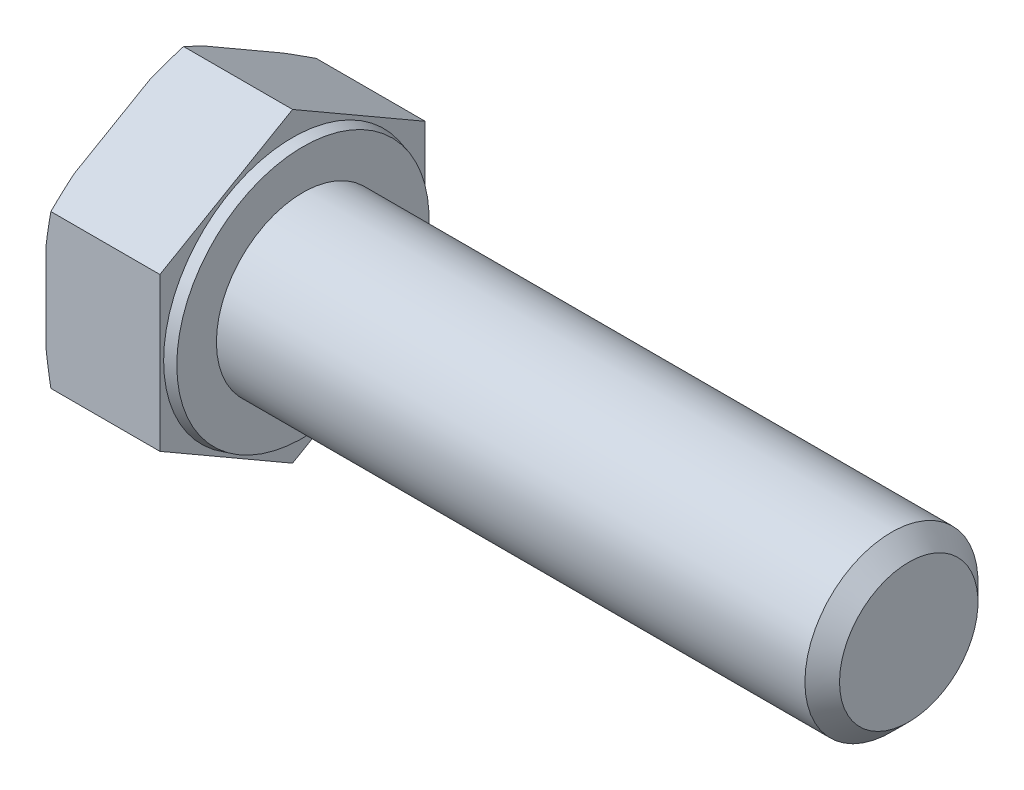
ISO-10303-21;
HEADER;
FILE_DESCRIPTION(('STEP AP214'),'2;1');
FILE_NAME('part.step','',(''),(''),'','','');
FILE_SCHEMA(('AUTOMOTIVE_DESIGN { 1 0 10303 214 1 1 1 1 }'));
ENDSEC;
DATA;
#1=APPLICATION_CONTEXT('core data for automotive mechanical design processes');
#2=APPLICATION_PROTOCOL_DEFINITION('international standard','automotive_design',2000,#1);
#3=PRODUCT_CONTEXT('',#1,'mechanical');
#4=PRODUCT('Part','Part','',(#3));
#5=PRODUCT_RELATED_PRODUCT_CATEGORY('part','',(#4));
#6=PRODUCT_DEFINITION_FORMATION('','',#4);
#7=PRODUCT_DEFINITION_CONTEXT('part definition',#1,'design');
#8=PRODUCT_DEFINITION('design','',#6,#7);
#9=PRODUCT_DEFINITION_SHAPE('','',#8);
#10=(LENGTH_UNIT() NAMED_UNIT(*) SI_UNIT(.MILLI.,.METRE.));
#11=(NAMED_UNIT(*) PLANE_ANGLE_UNIT() SI_UNIT($,.RADIAN.));
#12=(NAMED_UNIT(*) SI_UNIT($,.STERADIAN.) SOLID_ANGLE_UNIT());
#13=UNCERTAINTY_MEASURE_WITH_UNIT(LENGTH_MEASURE(1.E-05),#10,'distance_accuracy_value','');
#14=(GEOMETRIC_REPRESENTATION_CONTEXT(3) GLOBAL_UNCERTAINTY_ASSIGNED_CONTEXT((#13)) GLOBAL_UNIT_ASSIGNED_CONTEXT((#10,
#11,#12)) REPRESENTATION_CONTEXT('',''));
#15=CARTESIAN_POINT('',(0.,0.,0.));
#16=DIRECTION('',(0.,0.,1.));
#17=DIRECTION('',(1.,0.,0.));
#18=AXIS2_PLACEMENT_3D('',#15,#16,#17);
#19=CARTESIAN_POINT('',(35.6000000000001,-4.42500000000009,-7.66432482349223));
#20=DIRECTION('',(0.,-0.866025403784442,-0.499999999999995));
#21=DIRECTION('',(0.,0.499999999999995,-0.866025403784442));
#22=AXIS2_PLACEMENT_3D('',#19,#20,#21);
#23=PLANE('',#22);
#24=DIRECTION('',(-1.,0.,0.));
#25=VECTOR('',#24,1.);
#26=CARTESIAN_POINT('',(35.6000000000001,-8.85,0.));
#27=LINE('',#26,#25);
#28=CARTESIAN_POINT('',(0.,-8.85,0.));
#29=VERTEX_POINT('',#28);
#30=CARTESIAN_POINT('',(-6.29792306844368,-8.85,0.));
#31=VERTEX_POINT('',#30);
#32=EDGE_CURVE('E161',#29,#31,#27,.T.);
#33=ORIENTED_EDGE('',*,*,#32,.T.);
#34=CARTESIAN_POINT('',(-4.7699615006699,-11.9174022332107,5.3128965151713));
#35=CARTESIAN_POINT('',(-4.83614833570257,-11.8050473190038,5.11829209528478));
#36=CARTESIAN_POINT('',(-4.90167255003095,-11.6925948603644,4.92351872348535));
#37=CARTESIAN_POINT('',(-5.03118559698242,-11.4674663528304,4.53358471020429));
#38=CARTESIAN_POINT('',(-5.09517439305191,-11.3547902986816,4.33842405962226));
#39=CARTESIAN_POINT('',(-5.28456041407138,-11.0163157536771,3.75216895060564));
#40=CARTESIAN_POINT('',(-5.40733223857273,-10.7901468045143,3.3604328395613));
#41=CARTESIAN_POINT('',(-5.64480594732521,-10.3342684187143,2.57082831328319));
#42=CARTESIAN_POINT('',(-5.75941225873481,-10.1045464495324,2.17293819104533));
#43=CARTESIAN_POINT('',(-5.97591685440881,-9.6436033227612,1.37456127607789));
#44=CARTESIAN_POINT('',(-6.07781581130404,-9.41238224520544,0.974074621970502));
#45=CARTESIAN_POINT('',(-6.26134144326315,-8.95638364479248,0.184261877874948));
#46=CARTESIAN_POINT('',(-6.34355573274743,-8.73166601658844,-0.204960471530833));
#47=CARTESIAN_POINT('',(-6.48746045966098,-8.28055127837509,-0.986314118159495));
#48=CARTESIAN_POINT('',(-6.54915189984519,-8.05415425097466,-1.37844527229962));
#49=CARTESIAN_POINT('',(-6.62254434564547,-7.71410474496151,-1.9674282938031));
#50=CARTESIAN_POINT('',(-6.64378861584913,-7.60095958105454,-2.16340146632069));
#51=CARTESIAN_POINT('',(-6.67950592063896,-7.37440457175731,-2.55580625313272));
#52=CARTESIAN_POINT('',(-6.69397933196105,-7.26099474144627,-2.75223784130922));
#53=CARTESIAN_POINT('',(-6.7157765759338,-7.03401139991638,-3.14538452131075));
#54=CARTESIAN_POINT('',(-6.72310096885371,-6.92043790222291,-3.34209958970915));
#55=CARTESIAN_POINT('',(-6.73040192529392,-6.69323186195545,-3.73563199523894));
#56=CARTESIAN_POINT('',(-6.73037853713207,-6.57959931977464,-3.93244933168932));
#57=CARTESIAN_POINT('',(-6.72320871548941,-6.35929562962563,-4.31402651612232));
#58=CARTESIAN_POINT('',(-6.71649505277964,-6.25262090601261,-4.49879255730344));
#59=CARTESIAN_POINT('',(-6.69675463432834,-6.03941600442701,-4.86807427927243));
#60=CARTESIAN_POINT('',(-6.68372760236287,-5.93288583298343,-5.05258994875173));
#61=CARTESIAN_POINT('',(-6.63559663675346,-5.61363013252953,-5.60555704254388));
#62=CARTESIAN_POINT('',(-6.59144268713134,-5.40123548697151,-5.97343535990596));
#63=CARTESIAN_POINT('',(-6.48226269320506,-4.97681311893132,-6.70855646522027));
#64=CARTESIAN_POINT('',(-6.41713860156276,-4.7647919199632,-7.07578795411474));
#65=CARTESIAN_POINT('',(-6.27018625376656,-4.34222339340586,-7.80769811179158));
#66=CARTESIAN_POINT('',(-6.18835790112246,-4.1316760743376,-8.17237676581522));
#67=CARTESIAN_POINT('',(-6.00866271800198,-3.70472589760515,-8.91187616421634));
#68=CARTESIAN_POINT('',(-5.91033992742069,-3.48837165185492,-9.286612710289));
#69=CARTESIAN_POINT('',(-5.70311989656312,-3.05693413716248,-10.0338844060276));
#70=CARTESIAN_POINT('',(-5.59422212603359,-2.84185093252738,-10.4064194443103));
#71=CARTESIAN_POINT('',(-5.36943684134144,-2.41473283183158,-11.1462096955477));
#72=CARTESIAN_POINT('',(-5.25362330968472,-2.2026881429877,-11.5134818701005));
#73=CARTESIAN_POINT('',(-5.07537550670142,-1.88529185166037,-12.0632283728134));
#74=CARTESIAN_POINT('',(-5.01521325258259,-1.77961882394802,-12.2462594258008));
#75=CARTESIAN_POINT('',(-4.89354912869936,-1.56846779942573,-12.6119837283436));
#76=CARTESIAN_POINT('',(-4.83204728425027,-1.462989798971,-12.794676984212));
#77=CARTESIAN_POINT('',(-4.7699615006699,-1.35759776678936,-12.9772213386635));
#78=B_SPLINE_CURVE_WITH_KNOTS('',3,(#34,#35,#36,#37,#38,#39,#40,#41,#42,#43,#44,#45,#46,#47,#48,
#49,#50,#51,#52,#53,#54,#55,#56,#57,#58,#59,#60,#61,#62,#63,#64,#65,#66,#67,#68,#69,#70,#71,#72,
#73,#74,#75,#76,#77),.UNSPECIFIED.,.F.,.F.,(4,2,2,2,2,2,2,2,2,2,2,2,2,2,2,2,2,2,2,2,2,4),(0.,
0.70276173034238,1.40554017472233,2.81157217612387,4.23201032618944,5.6523732571052,
7.02270828812482,8.39297635416767,9.07474696516834,9.75647963740092,10.438158877887,
11.119833635759,11.7601005309412,12.4003954417532,13.6809617128842,14.9676044823533,
16.2542546841746,17.5852978857349,18.9164078632869,20.2352036230902,20.894426976119,
21.553637882061),.UNSPECIFIED.);
#79=CARTESIAN_POINT('',(-6.58000000000003,-7.90869530364146,-1.63038755949604));
#80=VERTEX_POINT('',#79);
#81=EDGE_CURVE('E206',#31,#80,#78,.T.);
#82=ORIENTED_EDGE('',*,*,#81,.T.);
#83=DIRECTION('',(0.,-0.499999999999995,0.866025403784442));
#84=VECTOR('',#83,1.);
#85=CARTESIAN_POINT('',(-6.58,-4.42500000000009,-7.66432482349223));
#86=LINE('',#85,#84);
#87=CARTESIAN_POINT('',(-6.58,-5.36630469635854,-6.03393726399618));
#88=VERTEX_POINT('',#87);
#89=EDGE_CURVE('E216',#88,#80,#86,.T.);
#90=ORIENTED_EDGE('',*,*,#89,.F.);
#91=CARTESIAN_POINT('',(-6.29792306844368,-4.42500000000009,-7.66432482349223));
#92=VERTEX_POINT('',#91);
#93=EDGE_CURVE('E219',#88,#92,#78,.T.);
#94=ORIENTED_EDGE('',*,*,#93,.T.);
#95=DIRECTION('',(-1.,0.,0.));
#96=VECTOR('',#95,1.);
#97=CARTESIAN_POINT('',(35.6000000000001,-4.42500000000009,-7.66432482349223));
#98=LINE('',#97,#96);
#99=CARTESIAN_POINT('',(0.,-4.42500000000009,-7.66432482349223));
#100=VERTEX_POINT('',#99);
#101=EDGE_CURVE('E172',#100,#92,#98,.T.);
#102=ORIENTED_EDGE('',*,*,#101,.F.);
#103=DIRECTION('',(0.,-0.499999999999995,0.866025403784442));
#104=VECTOR('',#103,1.);
#105=CARTESIAN_POINT('',(0.,-4.42500000000009,-7.66432482349223));
#106=LINE('',#105,#104);
#107=EDGE_CURVE('E187',#100,#29,#106,.T.);
#108=ORIENTED_EDGE('',*,*,#107,.T.);
#109=EDGE_LOOP('',(#33,#82,#90,#94,#102,#108));
#110=FACE_BOUND('',#109,.T.);
#111=ADVANCED_FACE('F39',(#110),#23,.T.);
#112=CARTESIAN_POINT('',(35.6000000000001,4.42499999999993,-7.66432482349232));
#113=DIRECTION('',(0.,0.,-1.));
#114=DIRECTION('',(0.,1.,0.));
#115=AXIS2_PLACEMENT_3D('',#112,#113,#114);
#116=PLANE('',#115);
#117=ORIENTED_EDGE('',*,*,#101,.T.);
#118=CARTESIAN_POINT('',(-5.00864005639831,-9.73789651517145,-7.66432482349217));
#119=CARTESIAN_POINT('',(-5.07003318744064,-9.52322769233334,-7.66432482349218));
#120=CARTESIAN_POINT('',(-5.13071664914256,-9.30835600664128,-7.66432482349218));
#121=CARTESIAN_POINT('',(-5.2504442425723,-8.87815277711283,-7.66432482349218));
#122=CARTESIAN_POINT('',(-5.30948834652955,-8.66282122555281,-7.66432482349219));
#123=CARTESIAN_POINT('',(-5.48387527888684,-8.01589307910885,-7.66432482349219));
#124=CARTESIAN_POINT('',(-5.59642298983084,-7.58353558067021,-7.6643248234922));
#125=CARTESIAN_POINT('',(-5.81266226723173,-6.71259000391773,-7.66432482349221));
#126=CARTESIAN_POINT('',(-5.91626806915323,-6.27398046842187,-7.66432482349221));
#127=CARTESIAN_POINT('',(-6.11029091280608,-5.39384656433909,-7.66432482349222));
#128=CARTESIAN_POINT('',(-6.20070892550878,-4.95232241284974,-7.66432482349222));
#129=CARTESIAN_POINT('',(-6.36160933963008,-4.08051166755351,-7.66432482349223));
#130=CARTESIAN_POINT('',(-6.43264625776086,-3.65032885049375,-7.66432482349224));
#131=CARTESIAN_POINT('',(-6.55428187483288,-2.78707107422335,-7.66432482349225));
#132=CARTESIAN_POINT('',(-6.60488453148917,-2.35399669158535,-7.66432482349225));
#133=CARTESIAN_POINT('',(-6.66240831794471,-1.70368188145931,-7.66432482349226));
#134=CARTESIAN_POINT('',(-6.67850532779577,-1.48723464984804,-7.66432482349226));
#135=CARTESIAN_POINT('',(-6.70429433272965,-1.05396299728827,-7.66432482349227));
#136=CARTESIAN_POINT('',(-6.71398664875919,-0.837138595786226,-7.66432482349227));
#137=CARTESIAN_POINT('',(-6.72672253024382,-0.403302294793051,-7.66432482349227));
#138=CARTESIAN_POINT('',(-6.72976638437883,-0.186290403852155,-7.66432482349227));
#139=CARTESIAN_POINT('',(-6.7291358967764,0.247718950123678,-7.66432482349228));
#140=CARTESIAN_POINT('',(-6.72546155695146,0.464716413162706,-7.66432482349228));
#141=CARTESIAN_POINT('',(-6.70624362970486,1.06036953223341,-7.66432482349229));
#142=CARTESIAN_POINT('',(-6.68388895075078,1.43882252598365,-7.66432482349229));
#143=CARTESIAN_POINT('',(-6.62050559151052,2.19412494594648,-7.6643248234923));
#144=CARTESIAN_POINT('',(-6.57947609181733,2.57097430106276,-7.6643248234923));
#145=CARTESIAN_POINT('',(-6.48113797206862,3.32388976987407,-7.66432482349231));
#146=CARTESIAN_POINT('',(-6.4237712185853,3.69994816672772,-7.66432482349232));
#147=CARTESIAN_POINT('',(-6.2956564145037,4.44978573942378,-7.66432482349232));
#148=CARTESIAN_POINT('',(-6.22490691200718,4.82356466341955,-7.66432482349233));
#149=CARTESIAN_POINT('',(-6.0704014797458,5.58003633732887,-7.66432482349234));
#150=CARTESIAN_POINT('',(-5.98632024183774,5.96266195818458,-7.66432482349234));
#151=CARTESIAN_POINT('',(-5.80919867667365,6.72583533235177,-7.66432482349235));
#152=CARTESIAN_POINT('',(-5.71615790531566,7.10638298167437,-7.66432482349235));
#153=CARTESIAN_POINT('',(-5.52374117974904,7.86297645537245,-7.66432482349236));
#154=CARTESIAN_POINT('',(-5.42441511026811,8.23903503370974,-7.66432482349236));
#155=CARTESIAN_POINT('',(-5.27134102225385,8.80195695976291,-7.66432482349237));
#156=CARTESIAN_POINT('',(-5.21964171692946,8.98938164843282,-7.66432482349237));
#157=CARTESIAN_POINT('',(-5.11502150400523,9.36388780999383,-7.66432482349237));
#158=CARTESIAN_POINT('',(-5.06210060924165,9.55096928646908,-7.66432482349238));
#159=CARTESIAN_POINT('',(-5.00864005639831,9.73789651517129,-7.66432482349238));
#160=B_SPLINE_CURVE_WITH_KNOTS('',3,(#118,#119,#120,#121,#122,#123,#124,#125,#126,#127,#128,
#129,#130,#131,#132,#133,#134,#135,#136,#137,#138,#139,#140,#141,#142,#143,#144,#145,#146,#147,
#148,#149,#150,#151,#152,#153,#154,#155,#156,#157,#158,#159),.UNSPECIFIED.,.F.,.F.,(4,2,2,2,2,2,
2,2,2,2,2,2,2,2,2,2,2,2,2,2,4),(0.,0.669823290546161,1.33965792092904,2.67986595636369,
4.03175825312792,5.38355096443301,6.69120700403605,7.99860965473741,8.64966414612008,
9.300686009923,9.95167960543101,10.6026730156168,11.7394565125237,12.876289893615,
14.0172201663474,15.1582742899967,16.3334026116279,17.5085892114817,18.6753990362947,
19.2586689197893,19.8419326771629),.UNSPECIFIED.);
#161=CARTESIAN_POINT('',(-6.58000000000003,-2.54239060728318,-7.66432482349217));
#162=VERTEX_POINT('',#161);
#163=EDGE_CURVE('E227',#92,#162,#160,.T.);
#164=ORIENTED_EDGE('',*,*,#163,.T.);
#165=DIRECTION('',(0.,-1.,0.));
#166=VECTOR('',#165,1.);
#167=CARTESIAN_POINT('',(-6.58,4.42499999999993,-7.66432482349232));
#168=LINE('',#167,#166);
#169=CARTESIAN_POINT('',(-6.58,2.54239060728305,-7.6643248234923));
#170=VERTEX_POINT('',#169);
#171=EDGE_CURVE('E167',#170,#162,#168,.T.);
#172=ORIENTED_EDGE('',*,*,#171,.F.);
#173=CARTESIAN_POINT('',(-6.29792306844368,4.42499999999993,-7.66432482349233));
#174=VERTEX_POINT('',#173);
#175=EDGE_CURVE('E54',#170,#174,#160,.T.);
#176=ORIENTED_EDGE('',*,*,#175,.T.);
#177=DIRECTION('',(-1.,0.,0.));
#178=VECTOR('',#177,1.);
#179=CARTESIAN_POINT('',(35.6000000000001,4.42499999999993,-7.66432482349232));
#180=LINE('',#179,#178);
#181=CARTESIAN_POINT('',(0.,4.42499999999993,-7.66432482349232));
#182=VERTEX_POINT('',#181);
#183=EDGE_CURVE('E158',#182,#174,#180,.T.);
#184=ORIENTED_EDGE('',*,*,#183,.F.);
#185=DIRECTION('',(0.,-1.,0.));
#186=VECTOR('',#185,1.);
#187=CARTESIAN_POINT('',(0.,8.84999999999992,-7.66432482349237));
#188=LINE('',#187,#186);
#189=EDGE_CURVE('E185',#182,#100,#188,.T.);
#190=ORIENTED_EDGE('',*,*,#189,.T.);
#191=EDGE_LOOP('',(#117,#164,#172,#176,#184,#190));
#192=FACE_BOUND('',#191,.T.);
#193=ADVANCED_FACE('F254',(#192),#116,.T.);
#194=CARTESIAN_POINT('',(35.6000000000001,8.85,0.));
#195=DIRECTION('',(0.,0.866025403784434,-0.500000000000007));
#196=DIRECTION('',(0.,0.500000000000007,0.866025403784435));
#197=AXIS2_PLACEMENT_3D('',#194,#195,#196);
#198=PLANE('',#197);
#199=ORIENTED_EDGE('',*,*,#183,.T.);
#200=CARTESIAN_POINT('',(-4.76996150066986,1.35759776678906,-12.9772213386637));
#201=CARTESIAN_POINT('',(-4.83614833570253,1.46995268099604,-12.7826169187772));
#202=CARTESIAN_POINT('',(-4.90167255003091,1.58240513963541,-12.5878435469777));
#203=CARTESIAN_POINT('',(-5.03118559698238,1.80753364716942,-12.1979095336967));
#204=CARTESIAN_POINT('',(-5.09517439305187,1.92020970131819,-12.0027488831146));
#205=CARTESIAN_POINT('',(-5.28456041407135,2.25868424632273,-11.416493774098));
#206=CARTESIAN_POINT('',(-5.40733223857269,2.48485319548548,-11.0247576630537));
#207=CARTESIAN_POINT('',(-5.64480594732518,2.9407315812855,-10.2351531367756));
#208=CARTESIAN_POINT('',(-5.75941225873478,3.17045355046743,-9.83726301453771));
#209=CARTESIAN_POINT('',(-5.97591685440879,3.63139667723867,-9.03888609957028));
#210=CARTESIAN_POINT('',(-6.07781581130402,3.86261775479443,-8.63839944546289));
#211=CARTESIAN_POINT('',(-6.26134144326313,4.3186163552074,-7.84858670136733));
#212=CARTESIAN_POINT('',(-6.34355573274742,4.54333398341145,-7.45936435196155));
#213=CARTESIAN_POINT('',(-6.48746045966097,4.99444872162481,-6.67801070533289));
#214=CARTESIAN_POINT('',(-6.54915189984519,5.22084574902526,-6.28587955119277));
#215=CARTESIAN_POINT('',(-6.62254434564547,5.56089525503842,-5.69689652968929));
#216=CARTESIAN_POINT('',(-6.64378861584913,5.67404041894539,-5.5009233571717));
#217=CARTESIAN_POINT('',(-6.67950592063896,5.90059542824263,-5.10851857035966));
#218=CARTESIAN_POINT('',(-6.69397933196106,6.01400525855367,-4.91208698218317));
#219=CARTESIAN_POINT('',(-6.7157765759338,6.24098860008357,-4.51894030218163));
#220=CARTESIAN_POINT('',(-6.72310096885372,6.35456209777704,-4.32222523378324));
#221=CARTESIAN_POINT('',(-6.73040192529394,6.58176813804451,-3.92869282825345));
#222=CARTESIAN_POINT('',(-6.73037853713208,6.69540068022533,-3.73187549180306));
#223=CARTESIAN_POINT('',(-6.72320871548943,6.91570437037435,-3.35029830737006));
#224=CARTESIAN_POINT('',(-6.71649505277966,7.02237909398737,-3.16553226618893));
#225=CARTESIAN_POINT('',(-6.69675463432836,7.23558399557298,-2.79625054421994));
#226=CARTESIAN_POINT('',(-6.68372760236289,7.34211416701656,-2.61173487474064));
#227=CARTESIAN_POINT('',(-6.63559663675348,7.66136986747048,-2.05876778094847));
#228=CARTESIAN_POINT('',(-6.59144268713136,7.87376451302852,-1.69088946358639));
#229=CARTESIAN_POINT('',(-6.48226269320508,8.29818688106872,-0.955768358272066));
#230=CARTESIAN_POINT('',(-6.41713860156277,8.51020808003686,-0.588536869377593));
#231=CARTESIAN_POINT('',(-6.27018625376657,8.93277660659422,0.143373288299262));
#232=CARTESIAN_POINT('',(-6.18835790112246,9.14332392566248,0.508051942322906));
#233=CARTESIAN_POINT('',(-6.00866271800198,9.57027410239495,1.24755134072404));
#234=CARTESIAN_POINT('',(-5.91033992742068,9.7866283481452,1.62228788679671));
#235=CARTESIAN_POINT('',(-5.7031198965631,10.2180658628377,2.36955958253528));
#236=CARTESIAN_POINT('',(-5.59422212603357,10.4331490674728,2.74209462081801));
#237=CARTESIAN_POINT('',(-5.36943684134141,10.8602671681686,3.48188487205548));
#238=CARTESIAN_POINT('',(-5.25362330968469,11.0723118570125,3.84915704660823));
#239=CARTESIAN_POINT('',(-5.07537550670138,11.3897081483398,4.39890354932111));
#240=CARTESIAN_POINT('',(-5.01521325258256,11.4953811760522,4.58193460230855));
#241=CARTESIAN_POINT('',(-4.89354912869931,11.7065322005745,4.94765890485139));
#242=CARTESIAN_POINT('',(-4.83204728425022,11.8120102010292,5.13035216071975));
#243=CARTESIAN_POINT('',(-4.76996150066986,11.9174022332109,5.3128965151713));
#244=B_SPLINE_CURVE_WITH_KNOTS('',3,(#200,#201,#202,#203,#204,#205,#206,#207,#208,#209,#210,
#211,#212,#213,#214,#215,#216,#217,#218,#219,#220,#221,#222,#223,#224,#225,#226,#227,#228,#229,
#230,#231,#232,#233,#234,#235,#236,#237,#238,#239,#240,#241,#242,#243),.UNSPECIFIED.,.F.,.F.,(4,
2,2,2,2,2,2,2,2,2,2,2,2,2,2,2,2,2,2,2,2,4),(0.,0.702761730342389,1.40554017472235,
2.8115721761239,4.23201032618948,5.65237325710526,7.02270828812488,8.39297635416774,
9.07474696516842,9.75647963740101,10.4381588778871,11.1198336357591,11.7601005309413,
12.4003954417533,13.6809617128843,14.9676044823535,16.2542546841748,17.5852978857351,
18.9164078632872,20.2352036230905,20.8944269761194,21.5536378820613),.UNSPECIFIED.);
#245=CARTESIAN_POINT('',(-6.58000000000003,5.36630469635833,-6.03393726399625));
#246=VERTEX_POINT('',#245);
#247=EDGE_CURVE('E249',#174,#246,#244,.T.);
#248=ORIENTED_EDGE('',*,*,#247,.T.);
#249=DIRECTION('',(0.,-0.500000000000007,-0.866025403784435));
#250=VECTOR('',#249,1.);
#251=CARTESIAN_POINT('',(-6.58,8.85,0.));
#252=LINE('',#251,#250);
#253=CARTESIAN_POINT('',(-6.58,7.90869530364155,-1.63038755949607));
#254=VERTEX_POINT('',#253);
#255=EDGE_CURVE('E239',#254,#246,#252,.T.);
#256=ORIENTED_EDGE('',*,*,#255,.F.);
#257=CARTESIAN_POINT('',(-6.29792306844368,8.85,0.));
#258=VERTEX_POINT('',#257);
#259=EDGE_CURVE('E62',#254,#258,#244,.T.);
#260=ORIENTED_EDGE('',*,*,#259,.T.);
#261=DIRECTION('',(-1.,0.,0.));
#262=VECTOR('',#261,1.);
#263=CARTESIAN_POINT('',(35.6000000000001,8.85,0.));
#264=LINE('',#263,#262);
#265=CARTESIAN_POINT('',(0.,8.85,0.));
#266=VERTEX_POINT('',#265);
#267=EDGE_CURVE('E155',#266,#258,#264,.T.);
#268=ORIENTED_EDGE('',*,*,#267,.F.);
#269=DIRECTION('',(0.,-0.500000000000007,-0.866025403784435));
#270=VECTOR('',#269,1.);
#271=CARTESIAN_POINT('',(0.,8.85000000000003,0.));
#272=LINE('',#271,#270);
#273=EDGE_CURVE('E183',#266,#182,#272,.T.);
#274=ORIENTED_EDGE('',*,*,#273,.T.);
#275=EDGE_LOOP('',(#199,#248,#256,#260,#268,#274));
#276=FACE_BOUND('',#275,.T.);
#277=ADVANCED_FACE('F247',(#276),#198,.T.);
#278=CARTESIAN_POINT('',(35.6000000000001,4.42500000000004,7.66432482349226));
#279=DIRECTION('',(0.,0.866025403784442,0.499999999999995));
#280=DIRECTION('',(0.,-0.499999999999995,0.866025403784442));
#281=AXIS2_PLACEMENT_3D('',#278,#279,#280);
#282=PLANE('',#281);
#283=ORIENTED_EDGE('',*,*,#267,.T.);
#284=CARTESIAN_POINT('',(-4.76996150066987,11.9174022332108,-5.31289651517143));
#285=CARTESIAN_POINT('',(-4.83614833570254,11.8050473190038,-5.1182920952849));
#286=CARTESIAN_POINT('',(-4.90167255003092,11.6925948603644,-4.92351872348547));
#287=CARTESIAN_POINT('',(-5.03118559698239,11.4674663528304,-4.53358471020441));
#288=CARTESIAN_POINT('',(-5.09517439305188,11.3547902986817,-4.33842405962238));
#289=CARTESIAN_POINT('',(-5.28456041407136,11.0163157536771,-3.75216895060575));
#290=CARTESIAN_POINT('',(-5.40733223857271,10.7901468045144,-3.36043283956141));
#291=CARTESIAN_POINT('',(-5.64480594732519,10.3342684187144,-2.5708283132833));
#292=CARTESIAN_POINT('',(-5.75941225873479,10.1045464495324,-2.17293819104543));
#293=CARTESIAN_POINT('',(-5.9759168544088,9.64360332276122,-1.374561276078));
#294=CARTESIAN_POINT('',(-6.07781581130403,9.41238224520547,-0.974074621970604));
#295=CARTESIAN_POINT('',(-6.26134144326314,8.9563836447925,-0.184261877875045));
#296=CARTESIAN_POINT('',(-6.34355573274742,8.73166601658846,0.204960471530737));
#297=CARTESIAN_POINT('',(-6.48746045966097,8.28055127837511,0.986314118159404));
#298=CARTESIAN_POINT('',(-6.54915189984519,8.05415425097468,1.37844527229953));
#299=CARTESIAN_POINT('',(-6.62254434564547,7.71410474496152,1.96742829380302));
#300=CARTESIAN_POINT('',(-6.64378861584914,7.60095958105455,2.1634014663206));
#301=CARTESIAN_POINT('',(-6.67950592063896,7.37440457175732,2.55580625313264));
#302=CARTESIAN_POINT('',(-6.69397933196106,7.26099474144628,2.75223784130914));
#303=CARTESIAN_POINT('',(-6.7157765759338,7.03401139991639,3.14538452131068));
#304=CARTESIAN_POINT('',(-6.72310096885372,6.92043790222292,3.34209958970907));
#305=CARTESIAN_POINT('',(-6.73040192529394,6.69323186195546,3.73563199523886));
#306=CARTESIAN_POINT('',(-6.73037853713208,6.57959931977464,3.93244933168925));
#307=CARTESIAN_POINT('',(-6.72320871548943,6.35929562962563,4.31402651612225));
#308=CARTESIAN_POINT('',(-6.71649505277966,6.25262090601261,4.49879255730338));
#309=CARTESIAN_POINT('',(-6.69675463432836,6.03941600442701,4.86807427927237));
#310=CARTESIAN_POINT('',(-6.68372760236289,5.93288583298343,5.05258994875167));
#311=CARTESIAN_POINT('',(-6.63559663675348,5.61363013252952,5.60555704254384));
#312=CARTESIAN_POINT('',(-6.59144268713136,5.40123548697149,5.97343535990593));
#313=CARTESIAN_POINT('',(-6.48226269320508,4.9768131189313,6.70855646522025));
#314=CARTESIAN_POINT('',(-6.41713860156277,4.76479191996317,7.07578795411472));
#315=CARTESIAN_POINT('',(-6.27018625376657,4.34222339340582,7.80769811179158));
#316=CARTESIAN_POINT('',(-6.18835790112247,4.13167607433756,8.17237676581522));
#317=CARTESIAN_POINT('',(-6.00866271800198,3.70472589760511,8.91187616421636));
#318=CARTESIAN_POINT('',(-5.91033992742069,3.48837165185487,9.28661271028903));
#319=CARTESIAN_POINT('',(-5.70311989656311,3.05693413716242,10.0338844060276));
#320=CARTESIAN_POINT('',(-5.59422212603358,2.84185093252732,10.4064194443103));
#321=CARTESIAN_POINT('',(-5.36943684134142,2.41473283183151,11.1462096955478));
#322=CARTESIAN_POINT('',(-5.2536233096847,2.20268814298763,11.5134818701005));
#323=CARTESIAN_POINT('',(-5.07537550670139,1.88529185166029,12.0632283728134));
#324=CARTESIAN_POINT('',(-5.01521325258257,1.77961882394793,12.2462594258009));
#325=CARTESIAN_POINT('',(-4.89354912869933,1.56846779942564,12.6119837283437));
#326=CARTESIAN_POINT('',(-4.83204728425023,1.46298979897091,12.7946769842121));
#327=CARTESIAN_POINT('',(-4.76996150066987,1.35759776678926,12.9772213386636));
#328=B_SPLINE_CURVE_WITH_KNOTS('',3,(#284,#285,#286,#287,#288,#289,#290,#291,#292,#293,#294,
#295,#296,#297,#298,#299,#300,#301,#302,#303,#304,#305,#306,#307,#308,#309,#310,#311,#312,#313,
#314,#315,#316,#317,#318,#319,#320,#321,#322,#323,#324,#325,#326,#327),.UNSPECIFIED.,.F.,.F.,(4,
2,2,2,2,2,2,2,2,2,2,2,2,2,2,2,2,2,2,2,2,4),(0.,0.702761730342384,1.40554017472234,
2.81157217612389,4.23201032618947,5.65237325710524,7.02270828812486,8.39297635416772,
9.0747469651684,9.75647963740098,10.4381588778871,11.119833635759,11.7601005309412,
12.4003954417533,13.6809617128843,14.9676044823535,16.2542546841747,17.585297885735,
18.9164078632871,20.2352036230904,20.8944269761193,21.5536378820612),.UNSPECIFIED.);
#329=CARTESIAN_POINT('',(-6.58000000000003,7.90869530364148,1.63038755949594));
#330=VERTEX_POINT('',#329);
#331=EDGE_CURVE('E149',#258,#330,#328,.T.);
#332=ORIENTED_EDGE('',*,*,#331,.T.);
#333=DIRECTION('',(0.,0.499999999999995,-0.866025403784442));
#334=VECTOR('',#333,1.);
#335=CARTESIAN_POINT('',(-6.58,4.42500000000004,7.66432482349226));
#336=LINE('',#335,#334);
#337=CARTESIAN_POINT('',(-6.58,5.36630469635847,6.03393726399624));
#338=VERTEX_POINT('',#337);
#339=EDGE_CURVE('E148',#338,#330,#336,.T.);
#340=ORIENTED_EDGE('',*,*,#339,.F.);
#341=CARTESIAN_POINT('',(-6.29792306844368,4.42500000000004,7.66432482349226));
#342=VERTEX_POINT('',#341);
#343=EDGE_CURVE('E130',#338,#342,#328,.T.);
#344=ORIENTED_EDGE('',*,*,#343,.T.);
#345=DIRECTION('',(-1.,0.,0.));
#346=VECTOR('',#345,1.);
#347=CARTESIAN_POINT('',(35.6000000000001,4.42500000000004,7.66432482349226));
#348=LINE('',#347,#346);
#349=CARTESIAN_POINT('',(0.,4.42500000000004,7.66432482349226));
#350=VERTEX_POINT('',#349);
#351=EDGE_CURVE('E144',#350,#342,#348,.T.);
#352=ORIENTED_EDGE('',*,*,#351,.F.);
#353=DIRECTION('',(0.,0.499999999999995,-0.866025403784442));
#354=VECTOR('',#353,1.);
#355=CARTESIAN_POINT('',(0.,8.84999999999997,0.));
#356=LINE('',#355,#354);
#357=EDGE_CURVE('E181',#350,#266,#356,.T.);
#358=ORIENTED_EDGE('',*,*,#357,.T.);
#359=EDGE_LOOP('',(#283,#332,#340,#344,#352,#358));
#360=FACE_BOUND('',#359,.T.);
#361=ADVANCED_FACE('F143',(#360),#282,.T.);
#362=CARTESIAN_POINT('',(35.6000000000001,-4.42499999999998,7.66432482349229));
#363=DIRECTION('',(0.,0.,1.));
#364=DIRECTION('',(0.,-1.,0.));
#365=AXIS2_PLACEMENT_3D('',#362,#363,#364);
#366=PLANE('',#365);
#367=ORIENTED_EDGE('',*,*,#351,.T.);
#368=CARTESIAN_POINT('',(-5.00864005639831,9.7378965151714,7.66432482349224));
#369=CARTESIAN_POINT('',(-5.07003318744064,9.52322769233328,7.66432482349224));
#370=CARTESIAN_POINT('',(-5.13071664914256,9.30835600664122,7.66432482349224));
#371=CARTESIAN_POINT('',(-5.2504442425723,8.87815277711278,7.66432482349225));
#372=CARTESIAN_POINT('',(-5.30948834652955,8.66282122555276,7.66432482349225));
#373=CARTESIAN_POINT('',(-5.48387527888684,8.0158930791088,7.66432482349225));
#374=CARTESIAN_POINT('',(-5.59642298983084,7.58353558067016,7.66432482349225));
#375=CARTESIAN_POINT('',(-5.81266226723173,6.71259000391768,7.66432482349225));
#376=CARTESIAN_POINT('',(-5.91626806915323,6.27398046842182,7.66432482349225));
#377=CARTESIAN_POINT('',(-6.11029091280608,5.39384656433903,7.66432482349226));
#378=CARTESIAN_POINT('',(-6.20070892550878,4.95232241284969,7.66432482349226));
#379=CARTESIAN_POINT('',(-6.36160933963008,4.08051166755345,7.66432482349226));
#380=CARTESIAN_POINT('',(-6.43264625776087,3.6503288504937,7.66432482349226));
#381=CARTESIAN_POINT('',(-6.55428187483288,2.7870710742233,7.66432482349227));
#382=CARTESIAN_POINT('',(-6.60488453148917,2.3539966915853,7.66432482349227));
#383=CARTESIAN_POINT('',(-6.66240831794471,1.70368188145926,7.66432482349227));
#384=CARTESIAN_POINT('',(-6.67850532779577,1.48723464984798,7.66432482349227));
#385=CARTESIAN_POINT('',(-6.70429433272965,1.05396299728821,7.66432482349227));
#386=CARTESIAN_POINT('',(-6.71398664875919,0.83713859578617,7.66432482349227));
#387=CARTESIAN_POINT('',(-6.72672253024382,0.403302294792995,7.66432482349227));
#388=CARTESIAN_POINT('',(-6.72976638437883,0.1862904038521,7.66432482349228));
#389=CARTESIAN_POINT('',(-6.7291358967764,-0.247718950123733,7.66432482349228));
#390=CARTESIAN_POINT('',(-6.72546155695146,-0.46471641316276,7.66432482349228));
#391=CARTESIAN_POINT('',(-6.70624362970486,-1.06036953223346,7.66432482349228));
#392=CARTESIAN_POINT('',(-6.68388895075078,-1.43882252598371,7.66432482349228));
#393=CARTESIAN_POINT('',(-6.62050559151052,-2.19412494594653,7.66432482349228));
#394=CARTESIAN_POINT('',(-6.57947609181733,-2.57097430106281,7.66432482349229));
#395=CARTESIAN_POINT('',(-6.48113797206862,-3.32388976987413,7.66432482349229));
#396=CARTESIAN_POINT('',(-6.4237712185853,-3.69994816672777,7.66432482349229));
#397=CARTESIAN_POINT('',(-6.2956564145037,-4.44978573942384,7.66432482349229));
#398=CARTESIAN_POINT('',(-6.22490691200718,-4.8235646634196,7.66432482349229));
#399=CARTESIAN_POINT('',(-6.0704014797458,-5.58003633732892,7.6643248234923));
#400=CARTESIAN_POINT('',(-5.98632024183774,-5.96266195818463,7.6643248234923));
#401=CARTESIAN_POINT('',(-5.80919867667365,-6.72583533235183,7.6643248234923));
#402=CARTESIAN_POINT('',(-5.71615790531566,-7.10638298167442,7.6643248234923));
#403=CARTESIAN_POINT('',(-5.52374117974904,-7.8629764553725,7.66432482349231));
#404=CARTESIAN_POINT('',(-5.42441511026811,-8.2390350337098,7.66432482349231));
#405=CARTESIAN_POINT('',(-5.27134102225385,-8.80195695976297,7.66432482349231));
#406=CARTESIAN_POINT('',(-5.21964171692946,-8.98938164843288,7.66432482349231));
#407=CARTESIAN_POINT('',(-5.11502150400523,-9.36388780999389,7.66432482349231));
#408=CARTESIAN_POINT('',(-5.06210060924165,-9.55096928646914,7.66432482349231));
#409=CARTESIAN_POINT('',(-5.00864005639831,-9.73789651517135,7.66432482349231));
#410=B_SPLINE_CURVE_WITH_KNOTS('',3,(#368,#369,#370,#371,#372,#373,#374,#375,#376,#377,#378,
#379,#380,#381,#382,#383,#384,#385,#386,#387,#388,#389,#390,#391,#392,#393,#394,#395,#396,#397,
#398,#399,#400,#401,#402,#403,#404,#405,#406,#407,#408,#409),.UNSPECIFIED.,.F.,.F.,(4,2,2,2,2,2,
2,2,2,2,2,2,2,2,2,2,2,2,2,2,4),(0.,0.669823290546161,1.33965792092904,2.67986595636369,
4.03175825312792,5.38355096443301,6.69120700403605,7.99860965473742,8.64966414612009,
9.300686009923,9.95167960543102,10.6026730156168,11.7394565125237,12.876289893615,
14.0172201663474,15.1582742899967,16.3334026116279,17.5085892114817,18.6753990362947,
19.2586689197893,19.8419326771629),.UNSPECIFIED.);
#411=CARTESIAN_POINT('',(-6.58000000000003,2.54239060728313,7.66432482349219));
#412=VERTEX_POINT('',#411);
#413=EDGE_CURVE('E127',#342,#412,#410,.T.);
#414=ORIENTED_EDGE('',*,*,#413,.T.);
#415=DIRECTION('',(0.,1.,0.));
#416=VECTOR('',#415,1.);
#417=CARTESIAN_POINT('',(-6.58,-4.42499999999998,7.66432482349229));
#418=LINE('',#417,#416);
#419=CARTESIAN_POINT('',(-6.58,-2.5423906072831,7.66432482349229));
#420=VERTEX_POINT('',#419);
#421=EDGE_CURVE('E225',#420,#412,#418,.T.);
#422=ORIENTED_EDGE('',*,*,#421,.F.);
#423=CARTESIAN_POINT('',(-6.29792306844368,-4.42499999999998,7.66432482349229));
#424=VERTEX_POINT('',#423);
#425=EDGE_CURVE('E137',#420,#424,#410,.T.);
#426=ORIENTED_EDGE('',*,*,#425,.T.);
#427=DIRECTION('',(-1.,0.,0.));
#428=VECTOR('',#427,1.);
#429=CARTESIAN_POINT('',(35.6000000000001,-4.42499999999998,7.66432482349229));
#430=LINE('',#429,#428);
#431=CARTESIAN_POINT('',(0.,-4.42499999999998,7.66432482349229));
#432=VERTEX_POINT('',#431);
#433=EDGE_CURVE('E156',#432,#424,#430,.T.);
#434=ORIENTED_EDGE('',*,*,#433,.F.);
#435=DIRECTION('',(0.,1.,0.));
#436=VECTOR('',#435,1.);
#437=CARTESIAN_POINT('',(0.,8.85000000000003,7.66432482349225));
#438=LINE('',#437,#436);
#439=EDGE_CURVE('E154',#432,#350,#438,.T.);
#440=ORIENTED_EDGE('',*,*,#439,.T.);
#441=EDGE_LOOP('',(#367,#414,#422,#426,#434,#440));
#442=FACE_BOUND('',#441,.T.);
#443=ADVANCED_FACE('F151',(#442),#366,.T.);
#444=CARTESIAN_POINT('',(35.6000000000001,-8.85,0.));
#445=DIRECTION('',(0.,-0.866025403784438,0.500000000000001));
#446=DIRECTION('',(0.,-0.500000000000001,-0.866025403784438));
#447=AXIS2_PLACEMENT_3D('',#444,#445,#446);
#448=PLANE('',#447);
#449=ORIENTED_EDGE('',*,*,#433,.T.);
#450=CARTESIAN_POINT('',(-4.76996150066987,-1.35759776678916,12.9772213386637));
#451=CARTESIAN_POINT('',(-4.83614833570253,-1.46995268099614,12.7826169187771));
#452=CARTESIAN_POINT('',(-4.90167255003091,-1.58240513963551,12.5878435469777));
#453=CARTESIAN_POINT('',(-5.03118559698239,-1.80753364716952,12.1979095336966));
#454=CARTESIAN_POINT('',(-5.09517439305187,-1.92020970131828,12.0027488831146));
#455=CARTESIAN_POINT('',(-5.28456041407135,-2.25868424632282,11.416493774098));
#456=CARTESIAN_POINT('',(-5.4073322385727,-2.48485319548557,11.0247576630537));
#457=CARTESIAN_POINT('',(-5.64480594732518,-2.94073158128559,10.2351531367755));
#458=CARTESIAN_POINT('',(-5.75941225873479,-3.17045355046751,9.83726301453767));
#459=CARTESIAN_POINT('',(-5.97591685440879,-3.63139667723874,9.03888609957024));
#460=CARTESIAN_POINT('',(-6.07781581130402,-3.8626177547945,8.63839944546285));
#461=CARTESIAN_POINT('',(-6.26134144326314,-4.31861635520747,7.84858670136729));
#462=CARTESIAN_POINT('',(-6.34355573274742,-4.54333398341151,7.45936435196151));
#463=CARTESIAN_POINT('',(-6.48746045966097,-4.99444872162487,6.67801070533285));
#464=CARTESIAN_POINT('',(-6.54915189984519,-5.22084574902531,6.28587955119273));
#465=CARTESIAN_POINT('',(-6.62254434564547,-5.56089525503846,5.69689652968924));
#466=CARTESIAN_POINT('',(-6.64378861584913,-5.67404041894544,5.50092335717165));
#467=CARTESIAN_POINT('',(-6.67950592063896,-5.90059542824267,5.10851857035961));
#468=CARTESIAN_POINT('',(-6.69397933196106,-6.01400525855371,4.91208698218312));
#469=CARTESIAN_POINT('',(-6.7157765759338,-6.24098860008361,4.51894030218158));
#470=CARTESIAN_POINT('',(-6.72310096885372,-6.35456209777708,4.32222523378319));
#471=CARTESIAN_POINT('',(-6.73040192529394,-6.58176813804454,3.92869282825339));
#472=CARTESIAN_POINT('',(-6.73037853713208,-6.69540068022536,3.73187549180301));
#473=CARTESIAN_POINT('',(-6.72320871548943,-6.91570437037438,3.35029830737001));
#474=CARTESIAN_POINT('',(-6.71649505277966,-7.0223790939874,3.16553226618888));
#475=CARTESIAN_POINT('',(-6.69675463432836,-7.235583995573,2.79625054421989));
#476=CARTESIAN_POINT('',(-6.68372760236289,-7.34211416701658,2.61173487474059));
#477=CARTESIAN_POINT('',(-6.63559663675348,-7.6613698674705,2.05876778094842));
#478=CARTESIAN_POINT('',(-6.59144268713136,-7.87376451302853,1.69088946358633));
#479=CARTESIAN_POINT('',(-6.48226269320508,-8.29818688106872,0.955768358272013));
#480=CARTESIAN_POINT('',(-6.41713860156277,-8.51020808003686,0.58853686937754));
#481=CARTESIAN_POINT('',(-6.27018625376657,-8.93277660659421,-0.143373288299316));
#482=CARTESIAN_POINT('',(-6.18835790112247,-9.14332392566247,-0.508051942322961));
#483=CARTESIAN_POINT('',(-6.00866271800198,-9.57027410239494,-1.2475513407241));
#484=CARTESIAN_POINT('',(-5.91033992742068,-9.78662834814518,-1.62228788679676));
#485=CARTESIAN_POINT('',(-5.70311989656311,-10.2180658628376,-2.36955958253533));
#486=CARTESIAN_POINT('',(-5.59422212603357,-10.4331490674727,-2.74209462081807));
#487=CARTESIAN_POINT('',(-5.36943684134142,-10.8602671681686,-3.48188487205554));
#488=CARTESIAN_POINT('',(-5.25362330968469,-11.0723118570124,-3.84915704660829));
#489=CARTESIAN_POINT('',(-5.07537550670139,-11.3897081483398,-4.39890354932117));
#490=CARTESIAN_POINT('',(-5.01521325258256,-11.4953811760521,-4.58193460230861));
#491=CARTESIAN_POINT('',(-4.89354912869932,-11.7065322005744,-4.94765890485144));
#492=CARTESIAN_POINT('',(-4.83204728425023,-11.8120102010292,-5.13035216071981));
#493=CARTESIAN_POINT('',(-4.76996150066987,-11.9174022332108,-5.31289651517136));
#494=B_SPLINE_CURVE_WITH_KNOTS('',3,(#450,#451,#452,#453,#454,#455,#456,#457,#458,#459,#460,
#461,#462,#463,#464,#465,#466,#467,#468,#469,#470,#471,#472,#473,#474,#475,#476,#477,#478,#479,
#480,#481,#482,#483,#484,#485,#486,#487,#488,#489,#490,#491,#492,#493),.UNSPECIFIED.,.F.,.F.,(4,
2,2,2,2,2,2,2,2,2,2,2,2,2,2,2,2,2,2,2,2,4),(0.,0.702761730342388,1.40554017472235,
2.81157217612389,4.23201032618948,5.65237325710525,7.02270828812487,8.39297635416773,
9.07474696516841,9.75647963740099,10.4381588778871,11.1198336357591,11.7601005309413,
12.4003954417533,13.6809617128843,14.9676044823535,16.2542546841747,17.5852978857351,
18.9164078632871,20.2352036230904,20.8944269761193,21.5536378820613),.UNSPECIFIED.);
#495=CARTESIAN_POINT('',(-6.58000000000003,-5.36630469635837,6.03393726399621));
#496=VERTEX_POINT('',#495);
#497=EDGE_CURVE('E217',#424,#496,#494,.T.);
#498=ORIENTED_EDGE('',*,*,#497,.T.);
#499=DIRECTION('',(0.,0.500000000000001,0.866025403784438));
#500=VECTOR('',#499,1.);
#501=CARTESIAN_POINT('',(-6.58,-8.85,0.));
#502=LINE('',#501,#500);
#503=CARTESIAN_POINT('',(-6.58,-7.90869530364156,1.63038755949602));
#504=VERTEX_POINT('',#503);
#505=EDGE_CURVE('E223',#504,#496,#502,.T.);
#506=ORIENTED_EDGE('',*,*,#505,.F.);
#507=EDGE_CURVE('E208',#504,#31,#494,.T.);
#508=ORIENTED_EDGE('',*,*,#507,.T.);
#509=ORIENTED_EDGE('',*,*,#32,.F.);
#510=DIRECTION('',(0.,0.500000000000001,0.866025403784438));
#511=VECTOR('',#510,1.);
#512=CARTESIAN_POINT('',(0.,-4.42499999999999,7.66432482349229));
#513=LINE('',#512,#511);
#514=EDGE_CURVE('E178',#29,#432,#513,.T.);
#515=ORIENTED_EDGE('',*,*,#514,.T.);
#516=EDGE_LOOP('',(#449,#498,#506,#508,#509,#515));
#517=FACE_BOUND('',#516,.T.);
#518=ADVANCED_FACE('F275',(#517),#448,.T.);
#519=CARTESIAN_POINT('',(-6.58,0.,0.));
#520=DIRECTION('',(1.,0.,0.));
#521=DIRECTION('',(0.,0.,-1.));
#522=AXIS2_PLACEMENT_3D('',#519,#520,#521);
#523=PLANE('',#522);
#524=CARTESIAN_POINT('',(-6.58,0.,0.));
#525=DIRECTION('',(1.,0.,0.));
#526=DIRECTION('',(0.,0.,-1.));
#527=AXIS2_PLACEMENT_3D('',#524,#525,#526);
#528=CIRCLE('',#527,8.07500000000009);
#529=EDGE_CURVE('E192',#170,#246,#528,.T.);
#530=ORIENTED_EDGE('',*,*,#529,.F.);
#531=ORIENTED_EDGE('',*,*,#171,.T.);
#532=EDGE_CURVE('E190',#88,#162,#528,.T.);
#533=ORIENTED_EDGE('',*,*,#532,.F.);
#534=ORIENTED_EDGE('',*,*,#89,.T.);
#535=EDGE_CURVE('E191',#504,#80,#528,.T.);
#536=ORIENTED_EDGE('',*,*,#535,.F.);
#537=ORIENTED_EDGE('',*,*,#505,.T.);
#538=EDGE_CURVE('E198',#420,#496,#528,.T.);
#539=ORIENTED_EDGE('',*,*,#538,.F.);
#540=ORIENTED_EDGE('',*,*,#421,.T.);
#541=CARTESIAN_POINT('',(-6.58000000000003,0.,0.));
#542=DIRECTION('',(-1.,0.,0.));
#543=DIRECTION('',(0.,0.,1.));
#544=AXIS2_PLACEMENT_3D('',#541,#542,#543);
#545=CIRCLE('',#544,8.075);
#546=EDGE_CURVE('E132',#412,#338,#545,.T.);
#547=ORIENTED_EDGE('',*,*,#546,.T.);
#548=ORIENTED_EDGE('',*,*,#339,.T.);
#549=EDGE_CURVE('E196',#254,#330,#528,.T.);
#550=ORIENTED_EDGE('',*,*,#549,.F.);
#551=ORIENTED_EDGE('',*,*,#255,.T.);
#552=EDGE_LOOP('',(#530,#531,#533,#534,#536,#537,#539,#540,#547,#548,#550,#551));
#553=FACE_BOUND('',#552,.T.);
#554=ADVANCED_FACE('F221',(#553),#523,.F.);
#555=CARTESIAN_POINT('',(0.,8.85,0.));
#556=DIRECTION('',(-1.,0.,0.));
#557=DIRECTION('',(0.,0.,1.));
#558=AXIS2_PLACEMENT_3D('',#555,#556,#557);
#559=PLANE('',#558);
#560=CARTESIAN_POINT('',(0.,0.,0.));
#561=DIRECTION('',(-1.,0.,0.));
#562=DIRECTION('',(0.,0.,1.));
#563=AXIS2_PLACEMENT_3D('',#560,#561,#562);
#564=CIRCLE('',#563,7.44897459621555);
#565=CARTESIAN_POINT('',(0.,0.,7.44897459621555));
#566=VERTEX_POINT('',#565);
#567=EDGE_CURVE('E175',#566,#566,#564,.T.);
#568=ORIENTED_EDGE('',*,*,#567,.T.);
#569=EDGE_LOOP('',(#568));
#570=FACE_BOUND('',#569,.T.);
#571=ORIENTED_EDGE('',*,*,#107,.F.);
#572=ORIENTED_EDGE('',*,*,#189,.F.);
#573=ORIENTED_EDGE('',*,*,#273,.F.);
#574=ORIENTED_EDGE('',*,*,#357,.F.);
#575=ORIENTED_EDGE('',*,*,#439,.F.);
#576=ORIENTED_EDGE('',*,*,#514,.F.);
#577=EDGE_LOOP('',(#571,#572,#573,#574,#575,#576));
#578=FACE_BOUND('',#577,.T.);
#579=ADVANCED_FACE('F259',(#570,#578),#559,.F.);
#580=CARTESIAN_POINT('',(0.599999999999934,0.,0.));
#581=DIRECTION('',(-1.,0.,0.));
#582=DIRECTION('',(0.,0.,1.));
#583=AXIS2_PLACEMENT_3D('',#580,#581,#582);
#584=CONICAL_SURFACE('',#583,7.28820508075687,0.261799387799175);
#585=ORIENTED_EDGE('',*,*,#567,.F.);
#586=EDGE_LOOP('',(#585));
#587=FACE_BOUND('',#586,.T.);
#588=CARTESIAN_POINT('',(0.599999999999934,0.,0.));
#589=DIRECTION('',(-1.,0.,0.));
#590=DIRECTION('',(0.,0.,1.));
#591=AXIS2_PLACEMENT_3D('',#588,#589,#590);
#592=CIRCLE('',#591,7.28820508075687);
#593=CARTESIAN_POINT('',(0.599999999999934,0.,7.28820508075687));
#594=VERTEX_POINT('',#593);
#595=EDGE_CURVE('E171',#594,#594,#592,.T.);
#596=ORIENTED_EDGE('',*,*,#595,.T.);
#597=EDGE_LOOP('',(#596));
#598=FACE_BOUND('',#597,.T.);
#599=ADVANCED_FACE('F328',(#587,#598),#584,.T.);
#600=CARTESIAN_POINT('',(0.6,7.28820508075687,0.));
#601=DIRECTION('',(-1.,0.,0.));
#602=DIRECTION('',(0.,0.,1.));
#603=AXIS2_PLACEMENT_3D('',#600,#601,#602);
#604=PLANE('',#603);
#605=ORIENTED_EDGE('',*,*,#595,.F.);
#606=EDGE_LOOP('',(#605));
#607=FACE_BOUND('',#606,.T.);
#608=CARTESIAN_POINT('',(0.599999999999934,0.,0.));
#609=DIRECTION('',(-1.,0.,0.));
#610=DIRECTION('',(0.,0.,1.));
#611=AXIS2_PLACEMENT_3D('',#608,#609,#610);
#612=CIRCLE('',#611,5.);
#613=CARTESIAN_POINT('',(0.599999999999934,0.,5.));
#614=VERTEX_POINT('',#613);
#615=EDGE_CURVE('E168',#614,#614,#612,.T.);
#616=ORIENTED_EDGE('',*,*,#615,.T.);
#617=EDGE_LOOP('',(#616));
#618=FACE_BOUND('',#617,.T.);
#619=ADVANCED_FACE('F325',(#607,#618),#604,.F.);
#620=CARTESIAN_POINT('',(-1000.,0.,0.));
#621=DIRECTION('',(-1.,0.,0.));
#622=DIRECTION('',(0.,0.,1.));
#623=AXIS2_PLACEMENT_3D('',#620,#621,#622);
#624=CYLINDRICAL_SURFACE('',#623,5.);
#625=CARTESIAN_POINT('',(34.6,0.,0.));
#626=DIRECTION('',(-1.,0.,0.));
#627=DIRECTION('',(0.,0.,1.));
#628=AXIS2_PLACEMENT_3D('',#625,#626,#627);
#629=CIRCLE('',#628,5.);
#630=CARTESIAN_POINT('',(34.6,0.,5.));
#631=VERTEX_POINT('',#630);
#632=EDGE_CURVE('E47',#631,#631,#629,.T.);
#633=ORIENTED_EDGE('',*,*,#632,.T.);
#634=EDGE_LOOP('',(#633));
#635=FACE_BOUND('',#634,.T.);
#636=ORIENTED_EDGE('',*,*,#615,.F.);
#637=EDGE_LOOP('',(#636));
#638=FACE_BOUND('',#637,.T.);
#639=ADVANCED_FACE('F321',(#635,#638),#624,.T.);
#640=CARTESIAN_POINT('',(35.6,5.,0.));
#641=DIRECTION('',(-1.,0.,0.));
#642=DIRECTION('',(0.,0.,1.));
#643=AXIS2_PLACEMENT_3D('',#640,#641,#642);
#644=PLANE('',#643);
#645=CARTESIAN_POINT('',(35.6,0.,0.));
#646=DIRECTION('',(-1.,0.,0.));
#647=DIRECTION('',(0.,0.,1.));
#648=AXIS2_PLACEMENT_3D('',#645,#646,#647);
#649=CIRCLE('',#648,4.0000000000001);
#650=CARTESIAN_POINT('',(35.6,0.,4.0000000000001));
#651=VERTEX_POINT('',#650);
#652=EDGE_CURVE('E12',#651,#651,#649,.F.);
#653=ORIENTED_EDGE('',*,*,#652,.T.);
#654=EDGE_LOOP('',(#653));
#655=FACE_BOUND('',#654,.T.);
#656=ADVANCED_FACE('F318',(#655),#644,.F.);
#657=CARTESIAN_POINT('',(-6.58000000000003,0.,0.));
#658=DIRECTION('',(1.,0.,0.));
#659=DIRECTION('',(0.,0.,-1.));
#660=AXIS2_PLACEMENT_3D('',#657,#658,#659);
#661=CONICAL_SURFACE('',#660,8.075,1.22173047639598);
#662=ORIENTED_EDGE('',*,*,#532,.T.);
#663=ORIENTED_EDGE('',*,*,#163,.F.);
#664=ORIENTED_EDGE('',*,*,#93,.F.);
#665=EDGE_LOOP('',(#662,#663,#664));
#666=FACE_BOUND('',#665,.T.);
#667=ADVANCED_FACE('F281',(#666),#661,.T.);
#668=ORIENTED_EDGE('',*,*,#507,.F.);
#669=ORIENTED_EDGE('',*,*,#535,.T.);
#670=ORIENTED_EDGE('',*,*,#81,.F.);
#671=EDGE_LOOP('',(#668,#669,#670));
#672=FACE_BOUND('',#671,.T.);
#673=ADVANCED_FACE('F205',(#672),#661,.T.);
#674=ORIENTED_EDGE('',*,*,#538,.T.);
#675=ORIENTED_EDGE('',*,*,#497,.F.);
#676=ORIENTED_EDGE('',*,*,#425,.F.);
#677=EDGE_LOOP('',(#674,#675,#676));
#678=FACE_BOUND('',#677,.T.);
#679=ADVANCED_FACE('F280',(#678),#661,.T.);
#680=ORIENTED_EDGE('',*,*,#546,.F.);
#681=ORIENTED_EDGE('',*,*,#413,.F.);
#682=ORIENTED_EDGE('',*,*,#343,.F.);
#683=EDGE_LOOP('',(#680,#681,#682));
#684=FACE_BOUND('',#683,.T.);
#685=ADVANCED_FACE('F129',(#684),#661,.T.);
#686=ORIENTED_EDGE('',*,*,#549,.T.);
#687=ORIENTED_EDGE('',*,*,#331,.F.);
#688=ORIENTED_EDGE('',*,*,#259,.F.);
#689=EDGE_LOOP('',(#686,#687,#688));
#690=FACE_BOUND('',#689,.T.);
#691=ADVANCED_FACE('F383',(#690),#661,.T.);
#692=ORIENTED_EDGE('',*,*,#529,.T.);
#693=ORIENTED_EDGE('',*,*,#247,.F.);
#694=ORIENTED_EDGE('',*,*,#175,.F.);
#695=EDGE_LOOP('',(#692,#693,#694));
#696=FACE_BOUND('',#695,.T.);
#697=ADVANCED_FACE('F367',(#696),#661,.T.);
#698=CARTESIAN_POINT('',(34.6,0.,0.));
#699=DIRECTION('',(-1.,0.,0.));
#700=DIRECTION('',(0.,0.,1.));
#701=AXIS2_PLACEMENT_3D('',#698,#699,#700);
#702=CONICAL_SURFACE('',#701,5.,0.785398163397375);
#703=ORIENTED_EDGE('',*,*,#652,.F.);
#704=EDGE_LOOP('',(#703));
#705=FACE_BOUND('',#704,.T.);
#706=ORIENTED_EDGE('',*,*,#632,.F.);
#707=EDGE_LOOP('',(#706));
#708=FACE_BOUND('',#707,.T.);
#709=ADVANCED_FACE('F41',(#705,#708),#702,.T.);
#710=CLOSED_SHELL('',(#111,#193,#277,#361,#443,#518,#554,#579,#599,#619,#639,#656,#667,#673,
#679,#685,#691,#697,#709));
#711=MANIFOLD_SOLID_BREP('B2',#710);
#712=ADVANCED_BREP_SHAPE_REPRESENTATION('',(#18,#711),#14);
#713=SHAPE_DEFINITION_REPRESENTATION(#9,#712);
ENDSEC;
END-ISO-10303-21;
